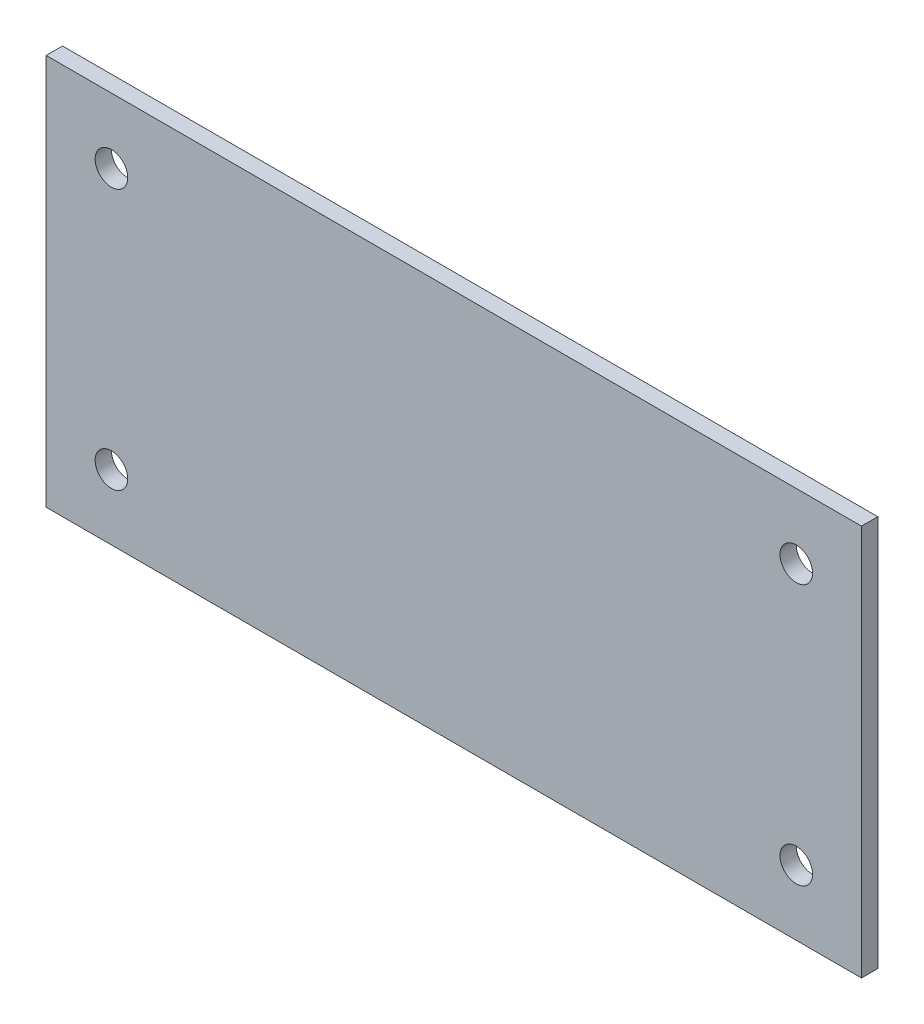
ISO-10303-21;
HEADER;
FILE_DESCRIPTION(('STEP AP214'),'2;1');
FILE_NAME('part.step','',(''),(''),'','','');
FILE_SCHEMA(('AUTOMOTIVE_DESIGN { 1 0 10303 214 1 1 1 1 }'));
ENDSEC;
DATA;
#1=APPLICATION_CONTEXT('core data for automotive mechanical design processes');
#2=APPLICATION_PROTOCOL_DEFINITION('international standard','automotive_design',2000,#1);
#3=PRODUCT_CONTEXT('',#1,'mechanical');
#4=PRODUCT('Part','Part','',(#3));
#5=PRODUCT_RELATED_PRODUCT_CATEGORY('part','',(#4));
#6=PRODUCT_DEFINITION_FORMATION('','',#4);
#7=PRODUCT_DEFINITION_CONTEXT('part definition',#1,'design');
#8=PRODUCT_DEFINITION('design','',#6,#7);
#9=PRODUCT_DEFINITION_SHAPE('','',#8);
#10=(LENGTH_UNIT() NAMED_UNIT(*) SI_UNIT(.MILLI.,.METRE.));
#11=(NAMED_UNIT(*) PLANE_ANGLE_UNIT() SI_UNIT($,.RADIAN.));
#12=(NAMED_UNIT(*) SI_UNIT($,.STERADIAN.) SOLID_ANGLE_UNIT());
#13=UNCERTAINTY_MEASURE_WITH_UNIT(LENGTH_MEASURE(1.E-05),#10,'distance_accuracy_value','');
#14=(GEOMETRIC_REPRESENTATION_CONTEXT(3) GLOBAL_UNCERTAINTY_ASSIGNED_CONTEXT((#13)) GLOBAL_UNIT_ASSIGNED_CONTEXT((#10,
#11,#12)) REPRESENTATION_CONTEXT('',''));
#15=CARTESIAN_POINT('',(0.,0.,0.));
#16=DIRECTION('',(0.,0.,1.));
#17=DIRECTION('',(1.,0.,0.));
#18=AXIS2_PLACEMENT_3D('',#15,#16,#17);
#19=CARTESIAN_POINT('',(0.,0.,5.));
#20=DIRECTION('',(0.,0.,1.));
#21=DIRECTION('',(1.,0.,0.));
#22=AXIS2_PLACEMENT_3D('',#19,#20,#21);
#23=PLANE('',#22);
#24=CARTESIAN_POINT('',(105.,-40.,5.));
#25=DIRECTION('',(0.,0.,1.));
#26=DIRECTION('',(1.,0.,0.));
#27=AXIS2_PLACEMENT_3D('',#24,#25,#26);
#28=CIRCLE('',#27,5.00000000000001);
#29=CARTESIAN_POINT('',(110.,-40.,5.));
#30=VERTEX_POINT('',#29);
#31=EDGE_CURVE('E123',#30,#30,#28,.T.);
#32=ORIENTED_EDGE('',*,*,#31,.F.);
#33=EDGE_LOOP('',(#32));
#34=FACE_BOUND('',#33,.T.);
#35=CARTESIAN_POINT('',(-105.,40.,5.));
#36=DIRECTION('',(0.,0.,1.));
#37=DIRECTION('',(1.,0.,0.));
#38=AXIS2_PLACEMENT_3D('',#35,#36,#37);
#39=CIRCLE('',#38,5.00000000000001);
#40=CARTESIAN_POINT('',(-100.,40.,5.));
#41=VERTEX_POINT('',#40);
#42=EDGE_CURVE('E102',#41,#41,#39,.T.);
#43=ORIENTED_EDGE('',*,*,#42,.F.);
#44=EDGE_LOOP('',(#43));
#45=FACE_BOUND('',#44,.T.);
#46=DIRECTION('',(0.,-1.,0.));
#47=VECTOR('',#46,1.);
#48=CARTESIAN_POINT('',(-125.,60.,5.));
#49=LINE('',#48,#47);
#50=CARTESIAN_POINT('',(-125.,60.,5.));
#51=VERTEX_POINT('',#50);
#52=CARTESIAN_POINT('',(-125.,-60.,5.));
#53=VERTEX_POINT('',#52);
#54=EDGE_CURVE('E87',#51,#53,#49,.T.);
#55=ORIENTED_EDGE('',*,*,#54,.T.);
#56=DIRECTION('',(1.,0.,0.));
#57=VECTOR('',#56,1.);
#58=CARTESIAN_POINT('',(-125.,-60.,5.));
#59=LINE('',#58,#57);
#60=CARTESIAN_POINT('',(125.,-60.,5.));
#61=VERTEX_POINT('',#60);
#62=EDGE_CURVE('E82',#53,#61,#59,.T.);
#63=ORIENTED_EDGE('',*,*,#62,.T.);
#64=DIRECTION('',(0.,1.,0.));
#65=VECTOR('',#64,1.);
#66=CARTESIAN_POINT('',(125.,60.,5.));
#67=LINE('',#66,#65);
#68=CARTESIAN_POINT('',(125.,60.,5.));
#69=VERTEX_POINT('',#68);
#70=EDGE_CURVE('E85',#61,#69,#67,.T.);
#71=ORIENTED_EDGE('',*,*,#70,.T.);
#72=DIRECTION('',(-1.,0.,0.));
#73=VECTOR('',#72,1.);
#74=CARTESIAN_POINT('',(-125.,60.,5.));
#75=LINE('',#74,#73);
#76=EDGE_CURVE('E52',#69,#51,#75,.T.);
#77=ORIENTED_EDGE('',*,*,#76,.T.);
#78=EDGE_LOOP('',(#55,#63,#71,#77));
#79=FACE_BOUND('',#78,.T.);
#80=CARTESIAN_POINT('',(105.,40.,5.));
#81=DIRECTION('',(0.,0.,1.));
#82=DIRECTION('',(-1.,0.,0.));
#83=AXIS2_PLACEMENT_3D('',#80,#81,#82);
#84=CIRCLE('',#83,5.00000000000001);
#85=CARTESIAN_POINT('',(100.,40.,5.));
#86=VERTEX_POINT('',#85);
#87=EDGE_CURVE('E117',#86,#86,#84,.T.);
#88=ORIENTED_EDGE('',*,*,#87,.F.);
#89=EDGE_LOOP('',(#88));
#90=FACE_BOUND('',#89,.T.);
#91=CARTESIAN_POINT('',(-105.,-40.,5.));
#92=DIRECTION('',(0.,0.,1.));
#93=DIRECTION('',(-1.,0.,0.));
#94=AXIS2_PLACEMENT_3D('',#91,#92,#93);
#95=CIRCLE('',#94,5.00000000000001);
#96=CARTESIAN_POINT('',(-110.,-40.,5.));
#97=VERTEX_POINT('',#96);
#98=EDGE_CURVE('E129',#97,#97,#95,.T.);
#99=ORIENTED_EDGE('',*,*,#98,.F.);
#100=EDGE_LOOP('',(#99));
#101=FACE_BOUND('',#100,.T.);
#102=ADVANCED_FACE('F35',(#34,#45,#79,#90,#101),#23,.T.);
#103=CARTESIAN_POINT('',(0.,0.,0.));
#104=DIRECTION('',(0.,0.,1.));
#105=DIRECTION('',(1.,0.,0.));
#106=AXIS2_PLACEMENT_3D('',#103,#104,#105);
#107=PLANE('',#106);
#108=DIRECTION('',(0.,-1.,0.));
#109=VECTOR('',#108,1.);
#110=CARTESIAN_POINT('',(-125.,60.,0.));
#111=LINE('',#110,#109);
#112=CARTESIAN_POINT('',(-125.,60.,0.));
#113=VERTEX_POINT('',#112);
#114=CARTESIAN_POINT('',(-125.,-60.,0.));
#115=VERTEX_POINT('',#114);
#116=EDGE_CURVE('E99',#113,#115,#111,.T.);
#117=ORIENTED_EDGE('',*,*,#116,.F.);
#118=DIRECTION('',(-1.,0.,0.));
#119=VECTOR('',#118,1.);
#120=CARTESIAN_POINT('',(-125.,60.,0.));
#121=LINE('',#120,#119);
#122=CARTESIAN_POINT('',(125.,60.,0.));
#123=VERTEX_POINT('',#122);
#124=EDGE_CURVE('E75',#123,#113,#121,.T.);
#125=ORIENTED_EDGE('',*,*,#124,.F.);
#126=DIRECTION('',(0.,1.,0.));
#127=VECTOR('',#126,1.);
#128=CARTESIAN_POINT('',(125.,60.,0.));
#129=LINE('',#128,#127);
#130=CARTESIAN_POINT('',(125.,-60.,0.));
#131=VERTEX_POINT('',#130);
#132=EDGE_CURVE('E69',#131,#123,#129,.T.);
#133=ORIENTED_EDGE('',*,*,#132,.F.);
#134=DIRECTION('',(1.,0.,0.));
#135=VECTOR('',#134,1.);
#136=CARTESIAN_POINT('',(-125.,-60.,0.));
#137=LINE('',#136,#135);
#138=EDGE_CURVE('E91',#115,#131,#137,.T.);
#139=ORIENTED_EDGE('',*,*,#138,.F.);
#140=EDGE_LOOP('',(#117,#125,#133,#139));
#141=FACE_BOUND('',#140,.T.);
#142=CARTESIAN_POINT('',(-105.,40.,0.));
#143=DIRECTION('',(0.,0.,1.));
#144=DIRECTION('',(1.,0.,0.));
#145=AXIS2_PLACEMENT_3D('',#142,#143,#144);
#146=CIRCLE('',#145,5.00000000000001);
#147=CARTESIAN_POINT('',(-100.,40.,0.));
#148=VERTEX_POINT('',#147);
#149=EDGE_CURVE('E114',#148,#148,#146,.T.);
#150=ORIENTED_EDGE('',*,*,#149,.T.);
#151=EDGE_LOOP('',(#150));
#152=FACE_BOUND('',#151,.T.);
#153=CARTESIAN_POINT('',(105.,40.,0.));
#154=DIRECTION('',(0.,0.,1.));
#155=DIRECTION('',(-1.,0.,0.));
#156=AXIS2_PLACEMENT_3D('',#153,#154,#155);
#157=CIRCLE('',#156,5.00000000000001);
#158=CARTESIAN_POINT('',(100.,40.,0.));
#159=VERTEX_POINT('',#158);
#160=EDGE_CURVE('E120',#159,#159,#157,.T.);
#161=ORIENTED_EDGE('',*,*,#160,.T.);
#162=EDGE_LOOP('',(#161));
#163=FACE_BOUND('',#162,.T.);
#164=CARTESIAN_POINT('',(105.,-40.,0.));
#165=DIRECTION('',(0.,0.,1.));
#166=DIRECTION('',(1.,0.,0.));
#167=AXIS2_PLACEMENT_3D('',#164,#165,#166);
#168=CIRCLE('',#167,5.00000000000001);
#169=CARTESIAN_POINT('',(110.,-40.,0.));
#170=VERTEX_POINT('',#169);
#171=EDGE_CURVE('E126',#170,#170,#168,.T.);
#172=ORIENTED_EDGE('',*,*,#171,.T.);
#173=EDGE_LOOP('',(#172));
#174=FACE_BOUND('',#173,.T.);
#175=CARTESIAN_POINT('',(-105.,-40.,0.));
#176=DIRECTION('',(0.,0.,1.));
#177=DIRECTION('',(-1.,0.,0.));
#178=AXIS2_PLACEMENT_3D('',#175,#176,#177);
#179=CIRCLE('',#178,5.00000000000001);
#180=CARTESIAN_POINT('',(-110.,-40.,0.));
#181=VERTEX_POINT('',#180);
#182=EDGE_CURVE('E132',#181,#181,#179,.T.);
#183=ORIENTED_EDGE('',*,*,#182,.T.);
#184=EDGE_LOOP('',(#183));
#185=FACE_BOUND('',#184,.T.);
#186=ADVANCED_FACE('F110',(#141,#152,#163,#174,#185),#107,.F.);
#187=CARTESIAN_POINT('',(-125.,60.,5.));
#188=DIRECTION('',(1.,0.,0.));
#189=DIRECTION('',(0.,0.,-1.));
#190=AXIS2_PLACEMENT_3D('',#187,#188,#189);
#191=PLANE('',#190);
#192=ORIENTED_EDGE('',*,*,#116,.T.);
#193=DIRECTION('',(0.,0.,-1.));
#194=VECTOR('',#193,1.);
#195=CARTESIAN_POINT('',(-125.,-60.,5.));
#196=LINE('',#195,#194);
#197=EDGE_CURVE('E11',#53,#115,#196,.T.);
#198=ORIENTED_EDGE('',*,*,#197,.F.);
#199=ORIENTED_EDGE('',*,*,#54,.F.);
#200=DIRECTION('',(0.,0.,-1.));
#201=VECTOR('',#200,1.);
#202=CARTESIAN_POINT('',(-125.,60.,5.));
#203=LINE('',#202,#201);
#204=EDGE_CURVE('E95',#51,#113,#203,.T.);
#205=ORIENTED_EDGE('',*,*,#204,.T.);
#206=EDGE_LOOP('',(#192,#198,#199,#205));
#207=FACE_BOUND('',#206,.T.);
#208=ADVANCED_FACE('F37',(#207),#191,.F.);
#209=CARTESIAN_POINT('',(-125.,-60.,5.));
#210=DIRECTION('',(0.,1.,0.));
#211=DIRECTION('',(0.,0.,1.));
#212=AXIS2_PLACEMENT_3D('',#209,#210,#211);
#213=PLANE('',#212);
#214=ORIENTED_EDGE('',*,*,#138,.T.);
#215=DIRECTION('',(0.,0.,-1.));
#216=VECTOR('',#215,1.);
#217=CARTESIAN_POINT('',(125.,-60.,5.));
#218=LINE('',#217,#216);
#219=EDGE_CURVE('E44',#61,#131,#218,.T.);
#220=ORIENTED_EDGE('',*,*,#219,.F.);
#221=ORIENTED_EDGE('',*,*,#62,.F.);
#222=ORIENTED_EDGE('',*,*,#197,.T.);
#223=EDGE_LOOP('',(#214,#220,#221,#222));
#224=FACE_BOUND('',#223,.T.);
#225=ADVANCED_FACE('F90',(#224),#213,.F.);
#226=CARTESIAN_POINT('',(125.,60.,5.));
#227=DIRECTION('',(-1.,0.,0.));
#228=DIRECTION('',(0.,-1.,0.));
#229=AXIS2_PLACEMENT_3D('',#226,#227,#228);
#230=PLANE('',#229);
#231=ORIENTED_EDGE('',*,*,#132,.T.);
#232=DIRECTION('',(0.,0.,-1.));
#233=VECTOR('',#232,1.);
#234=CARTESIAN_POINT('',(125.,60.,5.));
#235=LINE('',#234,#233);
#236=EDGE_CURVE('E92',#69,#123,#235,.T.);
#237=ORIENTED_EDGE('',*,*,#236,.F.);
#238=ORIENTED_EDGE('',*,*,#70,.F.);
#239=ORIENTED_EDGE('',*,*,#219,.T.);
#240=EDGE_LOOP('',(#231,#237,#238,#239));
#241=FACE_BOUND('',#240,.T.);
#242=ADVANCED_FACE('F93',(#241),#230,.F.);
#243=CARTESIAN_POINT('',(-125.,60.,5.));
#244=DIRECTION('',(0.,-1.,0.));
#245=DIRECTION('',(0.,0.,-1.));
#246=AXIS2_PLACEMENT_3D('',#243,#244,#245);
#247=PLANE('',#246);
#248=ORIENTED_EDGE('',*,*,#124,.T.);
#249=ORIENTED_EDGE('',*,*,#204,.F.);
#250=ORIENTED_EDGE('',*,*,#76,.F.);
#251=ORIENTED_EDGE('',*,*,#236,.T.);
#252=EDGE_LOOP('',(#248,#249,#250,#251));
#253=FACE_BOUND('',#252,.T.);
#254=ADVANCED_FACE('F107',(#253),#247,.F.);
#255=CARTESIAN_POINT('',(-105.,40.,5.));
#256=DIRECTION('',(0.,0.,-1.));
#257=DIRECTION('',(-1.,0.,0.));
#258=AXIS2_PLACEMENT_3D('',#255,#256,#257);
#259=CYLINDRICAL_SURFACE('',#258,5.00000000000001);
#260=ORIENTED_EDGE('',*,*,#42,.T.);
#261=EDGE_LOOP('',(#260));
#262=FACE_BOUND('',#261,.T.);
#263=ORIENTED_EDGE('',*,*,#149,.F.);
#264=EDGE_LOOP('',(#263));
#265=FACE_BOUND('',#264,.T.);
#266=ADVANCED_FACE('F151',(#262,#265),#259,.F.);
#267=CARTESIAN_POINT('',(105.,40.,5.));
#268=DIRECTION('',(0.,0.,-1.));
#269=DIRECTION('',(-1.,0.,0.));
#270=AXIS2_PLACEMENT_3D('',#267,#268,#269);
#271=CYLINDRICAL_SURFACE('',#270,5.00000000000001);
#272=ORIENTED_EDGE('',*,*,#87,.T.);
#273=EDGE_LOOP('',(#272));
#274=FACE_BOUND('',#273,.T.);
#275=ORIENTED_EDGE('',*,*,#160,.F.);
#276=EDGE_LOOP('',(#275));
#277=FACE_BOUND('',#276,.T.);
#278=ADVANCED_FACE('F197',(#274,#277),#271,.F.);
#279=CARTESIAN_POINT('',(105.,-40.,5.));
#280=DIRECTION('',(0.,0.,-1.));
#281=DIRECTION('',(-1.,0.,0.));
#282=AXIS2_PLACEMENT_3D('',#279,#280,#281);
#283=CYLINDRICAL_SURFACE('',#282,5.00000000000001);
#284=ORIENTED_EDGE('',*,*,#31,.T.);
#285=EDGE_LOOP('',(#284));
#286=FACE_BOUND('',#285,.T.);
#287=ORIENTED_EDGE('',*,*,#171,.F.);
#288=EDGE_LOOP('',(#287));
#289=FACE_BOUND('',#288,.T.);
#290=ADVANCED_FACE('F205',(#286,#289),#283,.F.);
#291=CARTESIAN_POINT('',(-105.,-40.,5.));
#292=DIRECTION('',(0.,0.,-1.));
#293=DIRECTION('',(-1.,0.,0.));
#294=AXIS2_PLACEMENT_3D('',#291,#292,#293);
#295=CYLINDRICAL_SURFACE('',#294,5.00000000000001);
#296=ORIENTED_EDGE('',*,*,#98,.T.);
#297=EDGE_LOOP('',(#296));
#298=FACE_BOUND('',#297,.T.);
#299=ORIENTED_EDGE('',*,*,#182,.F.);
#300=EDGE_LOOP('',(#299));
#301=FACE_BOUND('',#300,.T.);
#302=ADVANCED_FACE('F138',(#298,#301),#295,.F.);
#303=CLOSED_SHELL('',(#102,#186,#208,#225,#242,#254,#266,#278,#290,#302));
#304=MANIFOLD_SOLID_BREP('B2',#303);
#305=ADVANCED_BREP_SHAPE_REPRESENTATION('',(#18,#304),#14);
#306=SHAPE_DEFINITION_REPRESENTATION(#9,#305);
ENDSEC;
END-ISO-10303-21;
